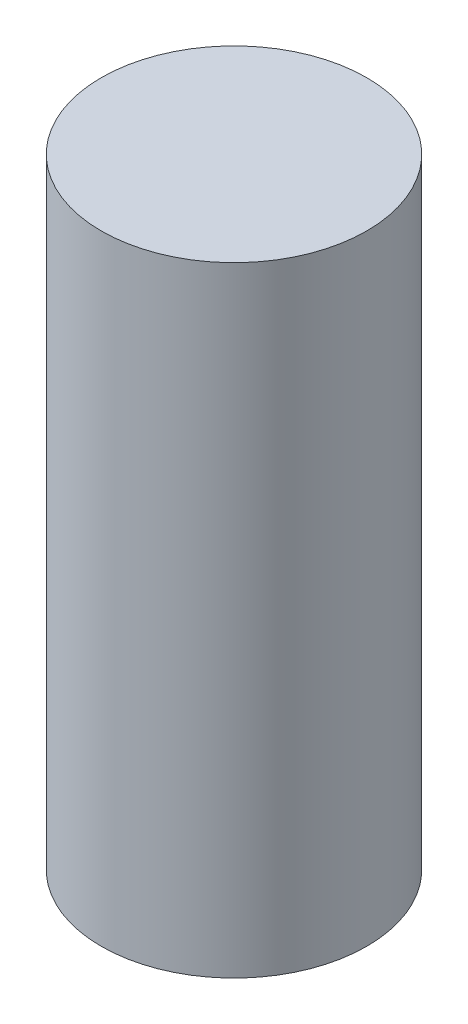
ISO-10303-21;
HEADER;
FILE_DESCRIPTION(('STEP AP214'),'2;1');
FILE_NAME('part.step','',(''),(''),'','','');
FILE_SCHEMA(('AUTOMOTIVE_DESIGN { 1 0 10303 214 1 1 1 1 }'));
ENDSEC;
DATA;
#1=APPLICATION_CONTEXT('core data for automotive mechanical design processes');
#2=APPLICATION_PROTOCOL_DEFINITION('international standard','automotive_design',2000,#1);
#3=PRODUCT_CONTEXT('',#1,'mechanical');
#4=PRODUCT('Part','Part','',(#3));
#5=PRODUCT_RELATED_PRODUCT_CATEGORY('part','',(#4));
#6=PRODUCT_DEFINITION_FORMATION('','',#4);
#7=PRODUCT_DEFINITION_CONTEXT('part definition',#1,'design');
#8=PRODUCT_DEFINITION('design','',#6,#7);
#9=PRODUCT_DEFINITION_SHAPE('','',#8);
#10=(LENGTH_UNIT() NAMED_UNIT(*) SI_UNIT(.MILLI.,.METRE.));
#11=(NAMED_UNIT(*) PLANE_ANGLE_UNIT() SI_UNIT($,.RADIAN.));
#12=(NAMED_UNIT(*) SI_UNIT($,.STERADIAN.) SOLID_ANGLE_UNIT());
#13=UNCERTAINTY_MEASURE_WITH_UNIT(LENGTH_MEASURE(1.E-05),#10,'distance_accuracy_value','');
#14=(GEOMETRIC_REPRESENTATION_CONTEXT(3) GLOBAL_UNCERTAINTY_ASSIGNED_CONTEXT((#13)) GLOBAL_UNIT_ASSIGNED_CONTEXT((#10,
#11,#12)) REPRESENTATION_CONTEXT('',''));
#15=CARTESIAN_POINT('',(0.,0.,0.));
#16=DIRECTION('',(0.,0.,1.));
#17=DIRECTION('',(1.,0.,0.));
#18=AXIS2_PLACEMENT_3D('',#15,#16,#17);
#19=CARTESIAN_POINT('',(-1.143,0.150539843938794,0.));
#20=DIRECTION('',(0.,-1.,0.));
#21=DIRECTION('',(0.,0.,-1.));
#22=AXIS2_PLACEMENT_3D('',#19,#20,#21);
#23=CYLINDRICAL_SURFACE('',#22,1.143);
#24=CARTESIAN_POINT('',(-1.143,0.,0.));
#25=DIRECTION('',(0.,-1.,0.));
#26=DIRECTION('',(0.,0.,-1.));
#27=AXIS2_PLACEMENT_3D('',#24,#25,#26);
#28=CIRCLE('',#27,1.143);
#29=CARTESIAN_POINT('',(-1.143,0.,-1.143));
#30=VERTEX_POINT('',#29);
#31=EDGE_CURVE('E10',#30,#30,#28,.T.);
#32=ORIENTED_EDGE('',*,*,#31,.T.);
#33=EDGE_LOOP('',(#32));
#34=FACE_BOUND('',#33,.T.);
#35=CARTESIAN_POINT('',(-1.143,5.08,0.));
#36=DIRECTION('',(0.,-1.,0.));
#37=DIRECTION('',(0.,0.,-1.));
#38=AXIS2_PLACEMENT_3D('',#35,#36,#37);
#39=CIRCLE('',#38,1.143);
#40=CARTESIAN_POINT('',(-1.143,5.08,-1.143));
#41=VERTEX_POINT('',#40);
#42=EDGE_CURVE('E45',#41,#41,#39,.T.);
#43=ORIENTED_EDGE('',*,*,#42,.F.);
#44=EDGE_LOOP('',(#43));
#45=FACE_BOUND('',#44,.T.);
#46=ADVANCED_FACE('F31',(#34,#45),#23,.F.);
#47=CARTESIAN_POINT('',(0.,0.,0.));
#48=DIRECTION('',(0.,-1.,0.));
#49=DIRECTION('',(0.,0.,-1.));
#50=AXIS2_PLACEMENT_3D('',#47,#48,#49);
#51=PLANE('',#50);
#52=CARTESIAN_POINT('',(-1.143,0.,0.));
#53=DIRECTION('',(0.,-1.,0.));
#54=DIRECTION('',(0.,0.,-1.));
#55=AXIS2_PLACEMENT_3D('',#52,#53,#54);
#56=CIRCLE('',#55,1.905);
#57=CARTESIAN_POINT('',(-1.143,0.,-1.905));
#58=VERTEX_POINT('',#57);
#59=EDGE_CURVE('E37',#58,#58,#56,.T.);
#60=ORIENTED_EDGE('',*,*,#59,.T.);
#61=EDGE_LOOP('',(#60));
#62=FACE_BOUND('',#61,.T.);
#63=ORIENTED_EDGE('',*,*,#31,.F.);
#64=EDGE_LOOP('',(#63));
#65=FACE_BOUND('',#64,.T.);
#66=ADVANCED_FACE('F54',(#62,#65),#51,.T.);
#67=CARTESIAN_POINT('',(-1.143,0.150539843938794,0.));
#68=DIRECTION('',(0.,-1.,0.));
#69=DIRECTION('',(0.,0.,-1.));
#70=AXIS2_PLACEMENT_3D('',#67,#68,#69);
#71=CYLINDRICAL_SURFACE('',#70,1.905);
#72=CARTESIAN_POINT('',(-1.143,8.89,0.));
#73=DIRECTION('',(0.,-1.,0.));
#74=DIRECTION('',(0.,0.,-1.));
#75=AXIS2_PLACEMENT_3D('',#72,#73,#74);
#76=CIRCLE('',#75,1.905);
#77=CARTESIAN_POINT('',(-1.143,8.89,-1.905));
#78=VERTEX_POINT('',#77);
#79=EDGE_CURVE('E41',#78,#78,#76,.T.);
#80=ORIENTED_EDGE('',*,*,#79,.T.);
#81=EDGE_LOOP('',(#80));
#82=FACE_BOUND('',#81,.T.);
#83=ORIENTED_EDGE('',*,*,#59,.F.);
#84=EDGE_LOOP('',(#83));
#85=FACE_BOUND('',#84,.T.);
#86=ADVANCED_FACE('F58',(#82,#85),#71,.T.);
#87=CARTESIAN_POINT('',(0.762000000000001,8.89,0.));
#88=DIRECTION('',(0.,1.,0.));
#89=DIRECTION('',(0.,0.,1.));
#90=AXIS2_PLACEMENT_3D('',#87,#88,#89);
#91=PLANE('',#90);
#92=ORIENTED_EDGE('',*,*,#79,.F.);
#93=EDGE_LOOP('',(#92));
#94=FACE_BOUND('',#93,.T.);
#95=ADVANCED_FACE('F62',(#94),#91,.T.);
#96=CARTESIAN_POINT('',(-1.143,5.08,0.));
#97=DIRECTION('',(0.,-1.,0.));
#98=DIRECTION('',(0.,0.,-1.));
#99=AXIS2_PLACEMENT_3D('',#96,#97,#98);
#100=PLANE('',#99);
#101=ORIENTED_EDGE('',*,*,#42,.T.);
#102=EDGE_LOOP('',(#101));
#103=FACE_BOUND('',#102,.T.);
#104=ADVANCED_FACE('F51',(#103),#100,.T.);
#105=CLOSED_SHELL('',(#46,#66,#86,#95,#104));
#106=MANIFOLD_SOLID_BREP('B2',#105);
#107=ADVANCED_BREP_SHAPE_REPRESENTATION('',(#18,#106),#14);
#108=SHAPE_DEFINITION_REPRESENTATION(#9,#107);
ENDSEC;
END-ISO-10303-21;
